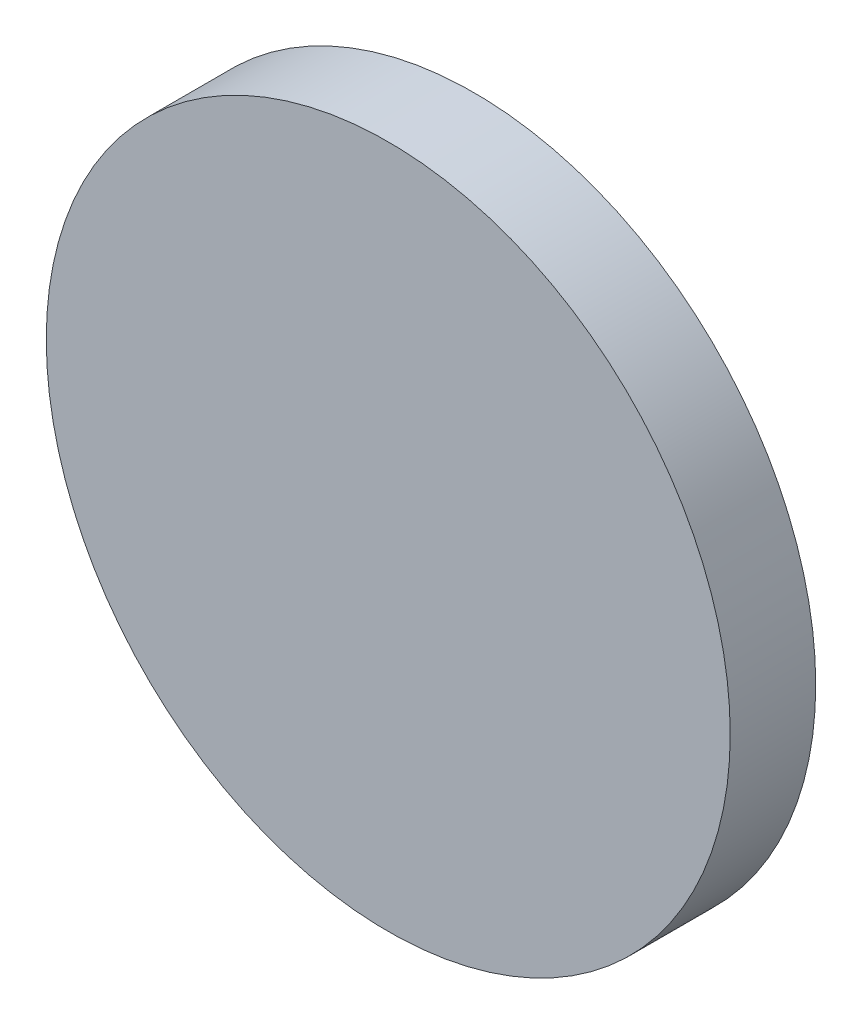
ISO-10303-21;
HEADER;
FILE_DESCRIPTION(('STEP AP214'),'2;1');
FILE_NAME('part.step','',(''),(''),'','','');
FILE_SCHEMA(('AUTOMOTIVE_DESIGN { 1 0 10303 214 1 1 1 1 }'));
ENDSEC;
DATA;
#1=APPLICATION_CONTEXT('core data for automotive mechanical design processes');
#2=APPLICATION_PROTOCOL_DEFINITION('international standard','automotive_design',2000,#1);
#3=PRODUCT_CONTEXT('',#1,'mechanical');
#4=PRODUCT('Part','Part','',(#3));
#5=PRODUCT_RELATED_PRODUCT_CATEGORY('part','',(#4));
#6=PRODUCT_DEFINITION_FORMATION('','',#4);
#7=PRODUCT_DEFINITION_CONTEXT('part definition',#1,'design');
#8=PRODUCT_DEFINITION('design','',#6,#7);
#9=PRODUCT_DEFINITION_SHAPE('','',#8);
#10=(LENGTH_UNIT() NAMED_UNIT(*) SI_UNIT(.MILLI.,.METRE.));
#11=(NAMED_UNIT(*) PLANE_ANGLE_UNIT() SI_UNIT($,.RADIAN.));
#12=(NAMED_UNIT(*) SI_UNIT($,.STERADIAN.) SOLID_ANGLE_UNIT());
#13=UNCERTAINTY_MEASURE_WITH_UNIT(LENGTH_MEASURE(1.E-05),#10,'distance_accuracy_value','');
#14=(GEOMETRIC_REPRESENTATION_CONTEXT(3) GLOBAL_UNCERTAINTY_ASSIGNED_CONTEXT((#13)) GLOBAL_UNIT_ASSIGNED_CONTEXT((#10,
#11,#12)) REPRESENTATION_CONTEXT('',''));
#15=CARTESIAN_POINT('',(0.,0.,0.));
#16=DIRECTION('',(0.,0.,1.));
#17=DIRECTION('',(1.,0.,0.));
#18=AXIS2_PLACEMENT_3D('',#15,#16,#17);
#19=CARTESIAN_POINT('',(0.,0.,-5.));
#20=DIRECTION('',(0.,0.,1.));
#21=DIRECTION('',(1.,0.,0.));
#22=AXIS2_PLACEMENT_3D('',#19,#20,#21);
#23=CYLINDRICAL_SURFACE('',#22,20.);
#24=CARTESIAN_POINT('',(0.,0.,-5.));
#25=DIRECTION('',(0.,0.,1.));
#26=DIRECTION('',(1.,0.,0.));
#27=AXIS2_PLACEMENT_3D('',#24,#25,#26);
#28=CIRCLE('',#27,20.);
#29=CARTESIAN_POINT('',(20.,0.,-5.));
#30=VERTEX_POINT('',#29);
#31=EDGE_CURVE('E10',#30,#30,#28,.T.);
#32=ORIENTED_EDGE('',*,*,#31,.T.);
#33=EDGE_LOOP('',(#32));
#34=FACE_BOUND('',#33,.T.);
#35=CARTESIAN_POINT('',(0.,0.,0.));
#36=DIRECTION('',(0.,0.,1.));
#37=DIRECTION('',(1.,0.,0.));
#38=AXIS2_PLACEMENT_3D('',#35,#36,#37);
#39=CIRCLE('',#38,20.);
#40=CARTESIAN_POINT('',(20.,0.,0.));
#41=VERTEX_POINT('',#40);
#42=EDGE_CURVE('E40',#41,#41,#39,.T.);
#43=ORIENTED_EDGE('',*,*,#42,.F.);
#44=EDGE_LOOP('',(#43));
#45=FACE_BOUND('',#44,.T.);
#46=ADVANCED_FACE('F37',(#34,#45),#23,.T.);
#47=CARTESIAN_POINT('',(0.,0.,-5.));
#48=DIRECTION('',(0.,0.,1.));
#49=DIRECTION('',(1.,0.,0.));
#50=AXIS2_PLACEMENT_3D('',#47,#48,#49);
#51=PLANE('',#50);
#52=ORIENTED_EDGE('',*,*,#31,.F.);
#53=EDGE_LOOP('',(#52));
#54=FACE_BOUND('',#53,.T.);
#55=ADVANCED_FACE('F52',(#54),#51,.F.);
#56=CARTESIAN_POINT('',(0.,0.,0.));
#57=DIRECTION('',(0.,0.,1.));
#58=DIRECTION('',(1.,0.,0.));
#59=AXIS2_PLACEMENT_3D('',#56,#57,#58);
#60=PLANE('',#59);
#61=ORIENTED_EDGE('',*,*,#42,.T.);
#62=EDGE_LOOP('',(#61));
#63=FACE_BOUND('',#62,.T.);
#64=ADVANCED_FACE('F49',(#63),#60,.T.);
#65=CLOSED_SHELL('',(#46,#55,#64));
#66=MANIFOLD_SOLID_BREP('B2',#65);
#67=ADVANCED_BREP_SHAPE_REPRESENTATION('',(#18,#66),#14);
#68=SHAPE_DEFINITION_REPRESENTATION(#9,#67);
ENDSEC;
END-ISO-10303-21;
